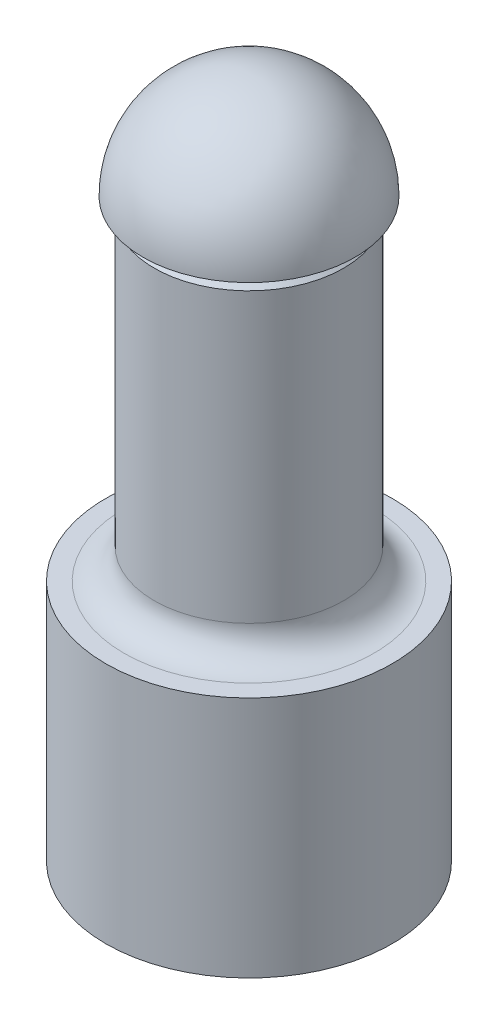
ISO-10303-21;
HEADER;
FILE_DESCRIPTION(('STEP AP214'),'2;1');
FILE_NAME('part.step','',(''),(''),'','','');
FILE_SCHEMA(('AUTOMOTIVE_DESIGN { 1 0 10303 214 1 1 1 1 }'));
ENDSEC;
DATA;
#1=APPLICATION_CONTEXT('core data for automotive mechanical design processes');
#2=APPLICATION_PROTOCOL_DEFINITION('international standard','automotive_design',2000,#1);
#3=PRODUCT_CONTEXT('',#1,'mechanical');
#4=PRODUCT('Part','Part','',(#3));
#5=PRODUCT_RELATED_PRODUCT_CATEGORY('part','',(#4));
#6=PRODUCT_DEFINITION_FORMATION('','',#4);
#7=PRODUCT_DEFINITION_CONTEXT('part definition',#1,'design');
#8=PRODUCT_DEFINITION('design','',#6,#7);
#9=PRODUCT_DEFINITION_SHAPE('','',#8);
#10=(LENGTH_UNIT() NAMED_UNIT(*) SI_UNIT(.MILLI.,.METRE.));
#11=(NAMED_UNIT(*) PLANE_ANGLE_UNIT() SI_UNIT($,.RADIAN.));
#12=(NAMED_UNIT(*) SI_UNIT($,.STERADIAN.) SOLID_ANGLE_UNIT());
#13=UNCERTAINTY_MEASURE_WITH_UNIT(LENGTH_MEASURE(1.E-05),#10,'distance_accuracy_value','');
#14=(GEOMETRIC_REPRESENTATION_CONTEXT(3) GLOBAL_UNCERTAINTY_ASSIGNED_CONTEXT((#13)) GLOBAL_UNIT_ASSIGNED_CONTEXT((#10,
#11,#12)) REPRESENTATION_CONTEXT('',''));
#15=CARTESIAN_POINT('',(0.,0.,0.));
#16=DIRECTION('',(0.,0.,1.));
#17=DIRECTION('',(1.,0.,0.));
#18=AXIS2_PLACEMENT_3D('',#15,#16,#17);
#19=CARTESIAN_POINT('',(0.,38.,0.));
#20=DIRECTION('',(0.,-1.,0.));
#21=DIRECTION('',(0.,0.,-1.));
#22=AXIS2_PLACEMENT_3D('',#19,#20,#21);
#23=CYLINDRICAL_SURFACE('',#22,6.25);
#24=CARTESIAN_POINT('',(0.,18.,0.));
#25=DIRECTION('',(0.,1.,0.));
#26=DIRECTION('',(0.,0.,1.));
#27=AXIS2_PLACEMENT_3D('',#24,#25,#26);
#28=CIRCLE('',#27,6.25);
#29=CARTESIAN_POINT('',(0.,18.,6.25));
#30=VERTEX_POINT('',#29);
#31=EDGE_CURVE('E169',#30,#30,#28,.T.);
#32=ORIENTED_EDGE('',*,*,#31,.T.);
#33=EDGE_LOOP('',(#32));
#34=FACE_BOUND('',#33,.T.);
#35=DIRECTION('',(0.,1.,0.));
#36=VECTOR('',#35,1.);
#37=CARTESIAN_POINT('',(3.75,31.65,-5.));
#38=LINE('',#37,#36);
#39=CARTESIAN_POINT('',(3.75,31.65,-5.));
#40=VERTEX_POINT('',#39);
#41=CARTESIAN_POINT('',(3.75,37.,-5.));
#42=VERTEX_POINT('',#41);
#43=EDGE_CURVE('E116',#40,#42,#38,.T.);
#44=ORIENTED_EDGE('',*,*,#43,.T.);
#45=CARTESIAN_POINT('',(0.,37.,0.));
#46=DIRECTION('',(0.,1.,0.));
#47=DIRECTION('',(0.,0.,1.));
#48=AXIS2_PLACEMENT_3D('',#45,#46,#47);
#49=CIRCLE('',#48,6.25);
#50=CARTESIAN_POINT('',(-3.75,37.,-5.));
#51=VERTEX_POINT('',#50);
#52=EDGE_CURVE('E11',#42,#51,#49,.F.);
#53=ORIENTED_EDGE('',*,*,#52,.T.);
#54=DIRECTION('',(0.,1.,0.));
#55=VECTOR('',#54,1.);
#56=CARTESIAN_POINT('',(-3.75,31.65,-5.));
#57=LINE('',#56,#55);
#58=CARTESIAN_POINT('',(-3.75,31.65,-5.));
#59=VERTEX_POINT('',#58);
#60=EDGE_CURVE('E113',#59,#51,#57,.T.);
#61=ORIENTED_EDGE('',*,*,#60,.F.);
#62=CARTESIAN_POINT('',(0.,31.65,0.));
#63=DIRECTION('',(0.,-1.,0.));
#64=DIRECTION('',(0.,0.,-1.));
#65=AXIS2_PLACEMENT_3D('',#62,#63,#64);
#66=CIRCLE('',#65,6.25);
#67=EDGE_CURVE('E108',#59,#40,#66,.T.);
#68=ORIENTED_EDGE('',*,*,#67,.T.);
#69=EDGE_LOOP('',(#44,#53,#61,#68));
#70=FACE_BOUND('',#69,.T.);
#71=ADVANCED_FACE('F33',(#34,#70),#23,.T.);
#72=CARTESIAN_POINT('',(0.,38.,0.));
#73=DIRECTION('',(0.,-1.,0.));
#74=DIRECTION('',(0.,0.,-1.));
#75=AXIS2_PLACEMENT_3D('',#72,#73,#74);
#76=CONICAL_SURFACE('',#75,5.25,0.785398163397446);
#77=ORIENTED_EDGE('',*,*,#52,.F.);
#78=CARTESIAN_POINT('',(8.29002378512647,33.5688588297679,-5.));
#79=CARTESIAN_POINT('',(8.16614251669939,33.6749361231169,-5.));
#80=CARTESIAN_POINT('',(8.04195113603972,33.7806513017223,-5.));
#81=CARTESIAN_POINT('',(7.79286649556736,33.9912561786033,-5.));
#82=CARTESIAN_POINT('',(7.66797322228908,34.0961458609486,-5.));
#83=CARTESIAN_POINT('',(7.29199983974314,34.4095232011861,-5.));
#84=CARTESIAN_POINT('',(7.03975001545882,34.6166127602617,-5.));
#85=CARTESIAN_POINT('',(6.52455121349022,35.0313769793787,-5.));
#86=CARTESIAN_POINT('',(6.26149618534369,35.2389204254966,-5.));
#87=CARTESIAN_POINT('',(5.73011200220583,35.6470260686123,-5.));
#88=CARTESIAN_POINT('',(5.46178420220096,35.8475900234066,-5.));
#89=CARTESIAN_POINT('',(4.91764396704006,36.2394807648945,-5.));
#90=CARTESIAN_POINT('',(4.64181887128266,36.430790186748,-5.));
#91=CARTESIAN_POINT('',(4.22104619943603,36.7073597513264,-5.));
#92=CARTESIAN_POINT('',(4.07954489930867,36.7978590743667,-5.));
#93=CARTESIAN_POINT('',(3.79389680416413,36.9745691123713,-5.));
#94=CARTESIAN_POINT('',(3.64975022266802,37.0607801714083,-5.));
#95=CARTESIAN_POINT('',(3.35982473727125,37.2271708727431,-5.));
#96=CARTESIAN_POINT('',(3.21407480767328,37.3074004907793,-5.));
#97=CARTESIAN_POINT('',(2.91927948004504,37.4615281677832,-5.));
#98=CARTESIAN_POINT('',(2.7702336973765,37.5354254827892,-5.));
#99=CARTESIAN_POINT('',(2.31806419025659,37.7452623294891,-5.));
#100=CARTESIAN_POINT('',(2.00925718022169,37.869734780335,-5.));
#101=CARTESIAN_POINT('',(1.53026084317916,38.0233372840257,-5.));
#102=CARTESIAN_POINT('',(1.36548992052156,38.0694279705218,-5.));
#103=CARTESIAN_POINT('',(1.03250820499218,38.1470709233458,-5.));
#104=CARTESIAN_POINT('',(0.864297963341555,38.1786255006005,-5.));
#105=CARTESIAN_POINT('',(0.526369836825327,38.2251397551932,-5.));
#106=CARTESIAN_POINT('',(0.356662838696765,38.2401771795937,-5.));
#107=CARTESIAN_POINT('',(0.016591504259577,38.2528593047653,-5.));
#108=CARTESIAN_POINT('',(-0.153772805588727,38.2505046985061,-5.));
#109=CARTESIAN_POINT('',(-0.49307773049109,38.2285963600873,-5.));
#110=CARTESIAN_POINT('',(-0.662020269134588,38.2090717849271,-5.));
#111=CARTESIAN_POINT('',(-0.997293739842109,38.1541968400732,-5.));
#112=CARTESIAN_POINT('',(-1.16362423346523,38.118843842301,-5.));
#113=CARTESIAN_POINT('',(-1.49370325897222,38.0341088453161,-5.));
#114=CARTESIAN_POINT('',(-1.65742970976553,37.9846421665406,-5.));
#115=CARTESIAN_POINT('',(-1.98083951154275,37.874070180418,-5.));
#116=CARTESIAN_POINT('',(-2.14052300377256,37.8129652803045,-5.));
#117=CARTESIAN_POINT('',(-2.50648586309427,37.6601332901038,-5.));
#118=CARTESIAN_POINT('',(-2.71127941478163,37.5648711175865,-5.));
#119=CARTESIAN_POINT('',(-3.11462139225852,37.3618354794766,-5.));
#120=CARTESIAN_POINT('',(-3.31316585944182,37.2540542784267,-5.));
#121=CARTESIAN_POINT('',(-3.70523278153265,37.0288298830716,-5.));
#122=CARTESIAN_POINT('',(-3.89874324848984,36.9113659874474,-5.));
#123=CARTESIAN_POINT('',(-4.28112776214398,36.669257489664,-5.));
#124=CARTESIAN_POINT('',(-4.47000279733919,36.5446144377599,-5.));
#125=CARTESIAN_POINT('',(-4.84481520001847,36.2891558694545,-5.));
#126=CARTESIAN_POINT('',(-5.03073458402061,36.1583140913852,-5.));
#127=CARTESIAN_POINT('',(-5.39938272712267,35.8922102390881,-5.));
#128=CARTESIAN_POINT('',(-5.58211135030662,35.7569479772636,-5.));
#129=CARTESIAN_POINT('',(-5.94469181170131,35.4830654211628,-5.));
#130=CARTESIAN_POINT('',(-6.12454676146867,35.3444492347281,-5.));
#131=CARTESIAN_POINT('',(-6.48202540532649,35.0643835672032,-5.));
#132=CARTESIAN_POINT('',(-6.65964915521256,34.9229341571939,-5.));
#133=CARTESIAN_POINT('',(-6.95948914808953,34.6809149190937,-5.));
#134=CARTESIAN_POINT('',(-7.08218894335945,34.5809427290541,-5.));
#135=CARTESIAN_POINT('',(-7.32679214759397,34.3799941239422,-5.));
#136=CARTESIAN_POINT('',(-7.44869544035717,34.2790175675339,-5.));
#137=CARTESIAN_POINT('',(-7.81149988355673,33.9762760727299,-5.));
#138=CARTESIAN_POINT('',(-8.05132396708158,33.7732177888546,-5.));
#139=CARTESIAN_POINT('',(-8.2900237851265,33.5688588297679,-5.));
#140=B_SPLINE_CURVE_WITH_KNOTS('',3,(#78,#79,#80,#81,#82,#83,#84,#85,#86,#87,#88,#89,#90,#91,
#92,#93,#94,#95,#96,#97,#98,#99,#100,#101,#102,#103,#104,#105,#106,#107,#108,#109,#110,#111,
#112,#113,#114,#115,#116,#117,#118,#119,#120,#121,#122,#123,#124,#125,#126,#127,#128,#129,#130,
#131,#132,#133,#134,#135,#136,#137,#138,#139),.UNSPECIFIED.,.F.,.F.,(4,2,2,2,2,2,2,2,2,2,2,2,2,
2,2,2,2,2,2,2,2,2,2,2,2,2,2,2,2,2,4),(0.,0.489274525632083,0.97855847010853,1.95761612929129,
2.96274011007906,3.96760908918487,4.97429572108149,5.47813426216425,5.98193231189071,
6.4808916726237,6.97990957433002,7.97567851882296,8.48844475876619,9.00112945181244,
9.51139043129033,10.0216310799886,10.5310069385133,11.0404674028509,11.5530512435592,
12.0656171517178,12.7426171608107,13.4200377333872,14.0989461683432,14.777708546595,
15.4596617120322,16.1416438559275,16.8228292346322,17.5039975448865,17.9788049418735,
18.4536801272861,19.3963713875946),.UNSPECIFIED.);
#141=CARTESIAN_POINT('',(1.60078105935824,38.,-5.));
#142=VERTEX_POINT('',#141);
#143=EDGE_CURVE('E126',#42,#142,#140,.T.);
#144=ORIENTED_EDGE('',*,*,#143,.T.);
#145=CARTESIAN_POINT('',(0.,38.,0.));
#146=DIRECTION('',(0.,1.,0.));
#147=DIRECTION('',(0.,0.,1.));
#148=AXIS2_PLACEMENT_3D('',#145,#146,#147);
#149=CIRCLE('',#148,5.25);
#150=CARTESIAN_POINT('',(-1.60078105935824,38.,-5.));
#151=VERTEX_POINT('',#150);
#152=EDGE_CURVE('E42',#151,#142,#149,.T.);
#153=ORIENTED_EDGE('',*,*,#152,.F.);
#154=EDGE_CURVE('E119',#151,#51,#140,.T.);
#155=ORIENTED_EDGE('',*,*,#154,.T.);
#156=EDGE_LOOP('',(#77,#144,#153,#155));
#157=FACE_BOUND('',#156,.T.);
#158=ADVANCED_FACE('F35',(#157),#76,.T.);
#159=CARTESIAN_POINT('',(0.,16.,0.));
#160=DIRECTION('',(0.,-1.,0.));
#161=DIRECTION('',(0.,0.,-1.));
#162=AXIS2_PLACEMENT_3D('',#159,#160,#161);
#163=CYLINDRICAL_SURFACE('',#162,9.45);
#164=CARTESIAN_POINT('',(1.25000000000003,6.35,-9.36696322187719));
#165=CARTESIAN_POINT('',(1.24999705018548,6.28011727092238,-9.36696427605041));
#166=CARTESIAN_POINT('',(1.24411989852458,6.21019171022277,-9.36775371704021));
#167=CARTESIAN_POINT('',(1.22076908923146,6.07228907673858,-9.37082473266134));
#168=CARTESIAN_POINT('',(1.20328353364291,6.00431407781821,-9.37310783817922));
#169=CARTESIAN_POINT('',(1.15724254781036,5.87232899868108,-9.37890316393424));
#170=CARTESIAN_POINT('',(1.12869489799618,5.80831616832437,-9.38241452012323));
#171=CARTESIAN_POINT('',(1.06135722680648,5.68600075125165,-9.39026966975857));
#172=CARTESIAN_POINT('',(1.0225688629955,5.62769724251519,-9.39461332845706));
#173=CARTESIAN_POINT('',(0.935591317286617,5.51807984660169,-9.40367405912545));
#174=CARTESIAN_POINT('',(0.887350831354171,5.46680682390543,-9.40839308149546));
#175=CARTESIAN_POINT('',(0.782948975523049,5.37305916071419,-9.41765532379069));
#176=CARTESIAN_POINT('',(0.726787200818071,5.33058497014516,-9.42219853471618));
#177=CARTESIAN_POINT('',(0.607878651857427,5.25549281594986,-9.43061735760494));
#178=CARTESIAN_POINT('',(0.545108204164357,5.22291203010293,-9.43449042841165));
#179=CARTESIAN_POINT('',(0.414926762421398,5.16876978061365,-9.44111109483429));
#180=CARTESIAN_POINT('',(0.347515960521759,5.14720786100732,-9.44385873701985));
#181=CARTESIAN_POINT('',(0.21038625333779,5.11583803794,-9.44790521738043));
#182=CARTESIAN_POINT('',(0.140683178614884,5.10596203269742,-9.44921244671988));
#183=CARTESIAN_POINT('',(0.000597651733215811,5.09803321429988,-9.45025949635613));
#184=CARTESIAN_POINT('',(-0.0697847705487154,5.09997988354299,-9.44999938527179));
#185=CARTESIAN_POINT('',(-0.208767401030502,5.11558680592925,-9.447947827348));
#186=CARTESIAN_POINT('',(-0.277375995843672,5.12917381098923,-9.44616595656816));
#187=CARTESIAN_POINT('',(-0.41133065984499,5.16756108868917,-9.44128181021904));
#188=CARTESIAN_POINT('',(-0.476676660783738,5.19236159579259,-9.43817950704087));
#189=CARTESIAN_POINT('',(-0.602476586185751,5.25254897933082,-9.43098656704904));
#190=CARTESIAN_POINT('',(-0.662915283406933,5.28796731837672,-9.4268929999646));
#191=CARTESIAN_POINT('',(-0.777018879315241,5.36836206063761,-9.41817504473578));
#192=CARTESIAN_POINT('',(-0.830683430104856,5.41333895442995,-9.41355062935209));
#193=CARTESIAN_POINT('',(-0.930146128423402,5.51198373789969,-9.40424625270296));
#194=CARTESIAN_POINT('',(-0.975880939885119,5.56571549765458,-9.39956613717453));
#195=CARTESIAN_POINT('',(-1.05769303406464,5.6801260197603,-9.39071264991562));
#196=CARTESIAN_POINT('',(-1.09377027959166,5.74080480886251,-9.38653928013662));
#197=CARTESIAN_POINT('',(-1.1552480975655,5.86744597994692,-9.37917190661151));
#198=CARTESIAN_POINT('',(-1.18064320620863,5.93341104531983,-9.37597840428295));
#199=CARTESIAN_POINT('',(-1.21997766406295,6.0687211754532,-9.37094186134598));
#200=CARTESIAN_POINT('',(-1.23391763408467,6.13806605682896,-9.36909874755394));
#201=CARTESIAN_POINT('',(-1.24986142110068,6.27760686825761,-9.36698519739795));
#202=CARTESIAN_POINT('',(-1.25195454804025,6.34779242223,-9.36670299414656));
#203=CARTESIAN_POINT('',(-1.24438124347941,6.48751321692383,-9.36771206548581));
#204=CARTESIAN_POINT('',(-1.23471509349773,6.55704847317333,-9.36900330240807));
#205=CARTESIAN_POINT('',(-1.20397297111229,6.69322472363418,-9.37300300829143));
#206=CARTESIAN_POINT('',(-1.18294058402526,6.7598757301627,-9.37570606213817));
#207=CARTESIAN_POINT('',(-1.13010801341492,6.88870541339743,-9.38222042752868));
#208=CARTESIAN_POINT('',(-1.09830740898957,6.95088391516968,-9.38603178239227));
#209=CARTESIAN_POINT('',(-1.02462289044301,7.06940662574201,-9.39436136925485));
#210=CARTESIAN_POINT('',(-0.982680614245584,7.12571426298288,-9.39888363762351));
#211=CARTESIAN_POINT('',(-0.889985465135742,7.23052296494351,-9.40811297953077));
#212=CARTESIAN_POINT('',(-0.839232207519866,7.27902368862098,-9.4128200611317));
#213=CARTESIAN_POINT('',(-0.729964778311953,7.36715744774746,-9.42192498274736));
#214=CARTESIAN_POINT('',(-0.671402952746825,7.40673165936338,-9.42632064754108));
#215=CARTESIAN_POINT('',(-0.548411314678051,7.4754812434035,-9.43427460167679));
#216=CARTESIAN_POINT('',(-0.483981632444197,7.50465684661215,-9.4378329096023));
#217=CARTESIAN_POINT('',(-0.351275433443851,7.55168474137899,-9.44370160683508));
#218=CARTESIAN_POINT('',(-0.283010955762925,7.56957052616218,-9.44601568431407));
#219=CARTESIAN_POINT('',(-0.144415039046699,7.59361988852714,-9.44915054992485));
#220=CARTESIAN_POINT('',(-0.0740837051493853,7.59978406132586,-9.44997141388111));
#221=CARTESIAN_POINT('',(0.0660761760454183,7.60020317113697,-9.45002689712046));
#222=CARTESIAN_POINT('',(0.135904465109912,7.59454861722582,-9.44927357172438));
#223=CARTESIAN_POINT('',(0.273608748503972,7.57168310908794,-9.44628937114868));
#224=CARTESIAN_POINT('',(0.341484745379725,7.55447216993379,-9.44405849789617));
#225=CARTESIAN_POINT('',(0.47334224817243,7.50901190473291,-9.43836870222859));
#226=CARTESIAN_POINT('',(0.537325458205531,7.48076744951874,-9.43491032176774));
#227=CARTESIAN_POINT('',(0.659658486057076,7.4140513214036,-9.42714761047706));
#228=CARTESIAN_POINT('',(0.718008204629322,7.37557946836958,-9.42284326474778));
#229=CARTESIAN_POINT('',(0.827879508461383,7.28916770101381,-9.41382924967101));
#230=CARTESIAN_POINT('',(0.87934799472036,7.24116055285499,-9.40911684441303));
#231=CARTESIAN_POINT('',(0.973533026574125,7.13718146262693,-9.39983931812206));
#232=CARTESIAN_POINT('',(1.01624750288669,7.08120764267351,-9.39527423212693));
#233=CARTESIAN_POINT('',(1.09187257357751,6.96260404385693,-9.38678715129327));
#234=CARTESIAN_POINT('',(1.12473997251106,6.89994652823979,-9.38286802285812));
#235=CARTESIAN_POINT('',(1.17943821904159,6.76998278804657,-9.37615015205914));
#236=CARTESIAN_POINT('',(1.20128092106387,6.70268164550575,-9.37335020695842));
#237=CARTESIAN_POINT('',(1.22815395024639,6.58753676837314,-9.36985867373476));
#238=CARTESIAN_POINT('',(1.23633423643678,6.54041552494926,-9.36877838051553));
#239=CARTESIAN_POINT('',(1.24725824547966,6.4455361908516,-9.36733029739633));
#240=CARTESIAN_POINT('',(1.25000201675802,6.39777810585431,-9.36696250114977));
#241=CARTESIAN_POINT('',(1.25000000000003,6.35,-9.36696322187719));
#242=B_SPLINE_CURVE_WITH_KNOTS('',3,(#164,#165,#166,#167,#168,#169,#170,#171,#172,#173,#174,
#175,#176,#177,#178,#179,#180,#181,#182,#183,#184,#185,#186,#187,#188,#189,#190,#191,#192,#193,
#194,#195,#196,#197,#198,#199,#200,#201,#202,#203,#204,#205,#206,#207,#208,#209,#210,#211,#212,
#213,#214,#215,#216,#217,#218,#219,#220,#221,#222,#223,#224,#225,#226,#227,#228,#229,#230,#231,
#232,#233,#234,#235,#236,#237,#238,#239,#240,#241),.UNSPECIFIED.,.T.,.F.,(4,2,2,2,2,2,2,2,2,2,2,
2,2,2,2,2,2,2,2,2,2,2,2,2,2,2,2,2,2,2,2,2,2,2,2,2,2,2,4),(0.,0.209473621706196,
0.419162274155716,0.628703710790636,0.838211251766887,1.04888913442063,1.2595777873743,
1.47104864535073,1.68251075189096,1.89273435835743,2.10294876120776,2.31185000203912,
2.52075561099493,2.73028646987189,2.93982808517902,3.15097311590379,3.3621189597253,
3.57337267154488,3.78461493372736,3.99426255818109,4.20390516374019,4.41274951332458,
4.62160202704251,4.83168628714925,5.04177972222452,5.25321961597895,5.46465481678988,
5.67545977292363,5.88625402421286,6.09543990704293,6.30462551703974,6.51371888457112,
6.72281593506481,6.93344331867698,7.14412043333472,7.35570861581199,7.56706879850634,
7.71028504311483,7.85350001201577),.UNSPECIFIED.);
#243=CARTESIAN_POINT('',(1.25000000000003,6.35,-9.36696322187719));
#244=VERTEX_POINT('',#243);
#245=EDGE_CURVE('E99',#244,#244,#242,.T.);
#246=ORIENTED_EDGE('',*,*,#245,.F.);
#247=EDGE_LOOP('',(#246));
#248=FACE_BOUND('',#247,.T.);
#249=CARTESIAN_POINT('',(0.,16.,0.));
#250=DIRECTION('',(0.,1.,0.));
#251=DIRECTION('',(0.,0.,1.));
#252=AXIS2_PLACEMENT_3D('',#249,#250,#251);
#253=CIRCLE('',#252,9.45);
#254=CARTESIAN_POINT('',(0.,16.,9.45));
#255=VERTEX_POINT('',#254);
#256=EDGE_CURVE('E170',#255,#255,#253,.T.);
#257=ORIENTED_EDGE('',*,*,#256,.F.);
#258=EDGE_LOOP('',(#257));
#259=FACE_BOUND('',#258,.T.);
#260=CARTESIAN_POINT('',(0.,0.,0.));
#261=DIRECTION('',(0.,1.,0.));
#262=DIRECTION('',(0.,0.,1.));
#263=AXIS2_PLACEMENT_3D('',#260,#261,#262);
#264=CIRCLE('',#263,9.45);
#265=CARTESIAN_POINT('',(0.,0.,9.45));
#266=VERTEX_POINT('',#265);
#267=EDGE_CURVE('E174',#266,#266,#264,.T.);
#268=ORIENTED_EDGE('',*,*,#267,.T.);
#269=EDGE_LOOP('',(#268));
#270=FACE_BOUND('',#269,.T.);
#271=ADVANCED_FACE('F149',(#248,#259,#270),#163,.T.);
#272=CARTESIAN_POINT('',(0.,16.,0.));
#273=DIRECTION('',(0.,1.,0.));
#274=DIRECTION('',(0.,0.,1.));
#275=AXIS2_PLACEMENT_3D('',#272,#273,#274);
#276=PLANE('',#275);
#277=CARTESIAN_POINT('',(0.,16.,0.));
#278=DIRECTION('',(0.,1.,0.));
#279=DIRECTION('',(0.,0.,1.));
#280=AXIS2_PLACEMENT_3D('',#277,#278,#279);
#281=CIRCLE('',#280,8.25);
#282=CARTESIAN_POINT('',(0.,16.,8.25));
#283=VERTEX_POINT('',#282);
#284=EDGE_CURVE('E166',#283,#283,#281,.F.);
#285=ORIENTED_EDGE('',*,*,#284,.T.);
#286=EDGE_LOOP('',(#285));
#287=FACE_BOUND('',#286,.T.);
#288=ORIENTED_EDGE('',*,*,#256,.T.);
#289=EDGE_LOOP('',(#288));
#290=FACE_BOUND('',#289,.T.);
#291=ADVANCED_FACE('F145',(#287,#290),#276,.T.);
#292=CARTESIAN_POINT('',(0.,0.,0.));
#293=DIRECTION('',(0.,1.,0.));
#294=DIRECTION('',(0.,0.,1.));
#295=AXIS2_PLACEMENT_3D('',#292,#293,#294);
#296=PLANE('',#295);
#297=DIRECTION('',(-1.,0.,0.));
#298=VECTOR('',#297,1.);
#299=CARTESIAN_POINT('',(4.15331193145907,0.,-4.99999999999997));
#300=LINE('',#299,#298);
#301=CARTESIAN_POINT('',(4.15331193145907,0.,-4.99999999999997));
#302=VERTEX_POINT('',#301);
#303=CARTESIAN_POINT('',(-4.153311931459,0.,-5.00000000000003));
#304=VERTEX_POINT('',#303);
#305=EDGE_CURVE('E95',#302,#304,#300,.T.);
#306=ORIENTED_EDGE('',*,*,#305,.T.);
#307=CARTESIAN_POINT('',(0.,0.,0.));
#308=DIRECTION('',(0.,-1.,0.));
#309=DIRECTION('',(0.,0.,-1.));
#310=AXIS2_PLACEMENT_3D('',#307,#308,#309);
#311=CIRCLE('',#310,6.5);
#312=EDGE_CURVE('E49',#302,#304,#311,.T.);
#313=ORIENTED_EDGE('',*,*,#312,.F.);
#314=EDGE_LOOP('',(#306,#313));
#315=FACE_BOUND('',#314,.T.);
#316=ORIENTED_EDGE('',*,*,#267,.F.);
#317=EDGE_LOOP('',(#316));
#318=FACE_BOUND('',#317,.T.);
#319=ADVANCED_FACE('F148',(#315,#318),#296,.F.);
#320=CARTESIAN_POINT('',(0.,18.,0.));
#321=DIRECTION('',(0.,1.,0.));
#322=DIRECTION('',(0.,0.,1.));
#323=AXIS2_PLACEMENT_3D('',#320,#321,#322);
#324=TOROIDAL_SURFACE('',#323,8.25,2.);
#325=ORIENTED_EDGE('',*,*,#284,.F.);
#326=EDGE_LOOP('',(#325));
#327=FACE_BOUND('',#326,.T.);
#328=ORIENTED_EDGE('',*,*,#31,.F.);
#329=EDGE_LOOP('',(#328));
#330=FACE_BOUND('',#329,.T.);
#331=ADVANCED_FACE('F144',(#327,#330),#324,.F.);
#332=CARTESIAN_POINT('',(0.,38.,0.));
#333=DIRECTION('',(0.,1.,0.));
#334=DIRECTION('',(0.,0.,1.));
#335=AXIS2_PLACEMENT_3D('',#332,#333,#334);
#336=PLANE('',#335);
#337=ORIENTED_EDGE('',*,*,#152,.T.);
#338=DIRECTION('',(-1.,0.,0.));
#339=VECTOR('',#338,1.);
#340=CARTESIAN_POINT('',(3.75,38.,-5.));
#341=LINE('',#340,#339);
#342=EDGE_CURVE('E56',#142,#151,#341,.T.);
#343=ORIENTED_EDGE('',*,*,#342,.T.);
#344=EDGE_LOOP('',(#337,#343));
#345=FACE_BOUND('',#344,.T.);
#346=CARTESIAN_POINT('',(0.,38.,0.));
#347=DIRECTION('',(0.,1.,0.));
#348=DIRECTION('',(0.,0.,1.));
#349=AXIS2_PLACEMENT_3D('',#346,#347,#348);
#350=CIRCLE('',#349,7.);
#351=CARTESIAN_POINT('',(0.,38.,7.));
#352=VERTEX_POINT('',#351);
#353=EDGE_CURVE('E127',#352,#352,#350,.T.);
#354=ORIENTED_EDGE('',*,*,#353,.F.);
#355=EDGE_LOOP('',(#354));
#356=FACE_BOUND('',#355,.T.);
#357=ADVANCED_FACE('F140',(#345,#356),#336,.F.);
#358=CARTESIAN_POINT('',(0.,38.,0.));
#359=DIRECTION('',(0.,1.,0.));
#360=DIRECTION('',(0.,0.,-1.));
#361=AXIS2_PLACEMENT_3D('',#358,#359,#360);
#362=SPHERICAL_SURFACE('',#361,7.);
#363=ORIENTED_EDGE('',*,*,#353,.T.);
#364=EDGE_LOOP('',(#363));
#365=FACE_BOUND('',#364,.T.);
#366=ADVANCED_FACE('F135',(#365),#362,.T.);
#367=CARTESIAN_POINT('',(3.75,31.65,-5.));
#368=DIRECTION('',(0.,0.,-1.));
#369=DIRECTION('',(-1.,0.,0.));
#370=AXIS2_PLACEMENT_3D('',#367,#368,#369);
#371=PLANE('',#370);
#372=ORIENTED_EDGE('',*,*,#43,.F.);
#373=DIRECTION('',(-1.,0.,0.));
#374=VECTOR('',#373,1.);
#375=CARTESIAN_POINT('',(3.75,31.65,-5.));
#376=LINE('',#375,#374);
#377=EDGE_CURVE('E111',#40,#59,#376,.T.);
#378=ORIENTED_EDGE('',*,*,#377,.T.);
#379=ORIENTED_EDGE('',*,*,#60,.T.);
#380=ORIENTED_EDGE('',*,*,#154,.F.);
#381=ORIENTED_EDGE('',*,*,#342,.F.);
#382=ORIENTED_EDGE('',*,*,#143,.F.);
#383=EDGE_LOOP('',(#372,#378,#379,#380,#381,#382));
#384=FACE_BOUND('',#383,.T.);
#385=ADVANCED_FACE('F129',(#384),#371,.T.);
#386=CARTESIAN_POINT('',(0.,31.65,0.));
#387=DIRECTION('',(0.,-1.,0.));
#388=DIRECTION('',(0.,0.,-1.));
#389=AXIS2_PLACEMENT_3D('',#386,#387,#388);
#390=PLANE('',#389);
#391=ORIENTED_EDGE('',*,*,#67,.F.);
#392=ORIENTED_EDGE('',*,*,#377,.F.);
#393=EDGE_LOOP('',(#391,#392));
#394=FACE_BOUND('',#393,.T.);
#395=ADVANCED_FACE('F134',(#394),#390,.F.);
#396=CARTESIAN_POINT('',(0.,12.7,0.));
#397=DIRECTION('',(0.,-1.,0.));
#398=DIRECTION('',(0.,0.,-1.));
#399=AXIS2_PLACEMENT_3D('',#396,#397,#398);
#400=CYLINDRICAL_SURFACE('',#399,6.5);
#401=ORIENTED_EDGE('',*,*,#312,.T.);
#402=DIRECTION('',(0.,-1.,0.));
#403=VECTOR('',#402,1.);
#404=CARTESIAN_POINT('',(-4.153311931459,12.7,-5.00000000000003));
#405=LINE('',#404,#403);
#406=CARTESIAN_POINT('',(-4.153311931459,12.7,-5.00000000000003));
#407=VERTEX_POINT('',#406);
#408=EDGE_CURVE('E84',#407,#304,#405,.T.);
#409=ORIENTED_EDGE('',*,*,#408,.F.);
#410=CARTESIAN_POINT('',(0.,12.7,0.));
#411=DIRECTION('',(0.,-1.,0.));
#412=DIRECTION('',(0.,0.,-1.));
#413=AXIS2_PLACEMENT_3D('',#410,#411,#412);
#414=CIRCLE('',#413,6.5);
#415=CARTESIAN_POINT('',(4.15331193145907,12.7,-4.99999999999997));
#416=VERTEX_POINT('',#415);
#417=EDGE_CURVE('E90',#416,#407,#414,.T.);
#418=ORIENTED_EDGE('',*,*,#417,.F.);
#419=DIRECTION('',(0.,-1.,0.));
#420=VECTOR('',#419,1.);
#421=CARTESIAN_POINT('',(4.15331193145907,12.7,-4.99999999999997));
#422=LINE('',#421,#420);
#423=EDGE_CURVE('E86',#416,#302,#422,.T.);
#424=ORIENTED_EDGE('',*,*,#423,.T.);
#425=EDGE_LOOP('',(#401,#409,#418,#424));
#426=FACE_BOUND('',#425,.T.);
#427=ADVANCED_FACE('F92',(#426),#400,.F.);
#428=CARTESIAN_POINT('',(4.15331193145907,12.7,-4.99999999999997));
#429=DIRECTION('',(0.,0.,1.));
#430=DIRECTION('',(1.,0.,0.));
#431=AXIS2_PLACEMENT_3D('',#428,#429,#430);
#432=PLANE('',#431);
#433=CARTESIAN_POINT('',(0.,6.35,-5.));
#434=DIRECTION('',(0.,0.,1.));
#435=DIRECTION('',(1.,0.,0.));
#436=AXIS2_PLACEMENT_3D('',#433,#434,#435);
#437=CIRCLE('',#436,1.25);
#438=CARTESIAN_POINT('',(1.25000000000003,6.35,-5.));
#439=VERTEX_POINT('',#438);
#440=EDGE_CURVE('E215',#439,#439,#437,.T.);
#441=ORIENTED_EDGE('',*,*,#440,.F.);
#442=EDGE_LOOP('',(#441));
#443=FACE_BOUND('',#442,.T.);
#444=ORIENTED_EDGE('',*,*,#305,.F.);
#445=ORIENTED_EDGE('',*,*,#423,.F.);
#446=DIRECTION('',(-1.,0.,0.));
#447=VECTOR('',#446,1.);
#448=CARTESIAN_POINT('',(4.15331193145907,12.7,-4.99999999999997));
#449=LINE('',#448,#447);
#450=EDGE_CURVE('E81',#416,#407,#449,.T.);
#451=ORIENTED_EDGE('',*,*,#450,.T.);
#452=ORIENTED_EDGE('',*,*,#408,.T.);
#453=EDGE_LOOP('',(#444,#445,#451,#452));
#454=FACE_BOUND('',#453,.T.);
#455=ADVANCED_FACE('F83',(#443,#454),#432,.T.);
#456=CARTESIAN_POINT('',(0.,12.7,0.));
#457=DIRECTION('',(0.,-1.,0.));
#458=DIRECTION('',(0.,0.,-1.));
#459=AXIS2_PLACEMENT_3D('',#456,#457,#458);
#460=PLANE('',#459);
#461=ORIENTED_EDGE('',*,*,#417,.T.);
#462=ORIENTED_EDGE('',*,*,#450,.F.);
#463=EDGE_LOOP('',(#461,#462));
#464=FACE_BOUND('',#463,.T.);
#465=ADVANCED_FACE('F94',(#464),#460,.T.);
#466=CARTESIAN_POINT('',(0.,6.35,-9.451));
#467=DIRECTION('',(0.,0.,1.));
#468=DIRECTION('',(1.,0.,0.));
#469=AXIS2_PLACEMENT_3D('',#466,#467,#468);
#470=CYLINDRICAL_SURFACE('',#469,1.25);
#471=ORIENTED_EDGE('',*,*,#245,.T.);
#472=EDGE_LOOP('',(#471));
#473=FACE_BOUND('',#472,.T.);
#474=ORIENTED_EDGE('',*,*,#440,.T.);
#475=EDGE_LOOP('',(#474));
#476=FACE_BOUND('',#475,.T.);
#477=ADVANCED_FACE('F203',(#473,#476),#470,.F.);
#478=CLOSED_SHELL('',(#71,#158,#271,#291,#319,#331,#357,#366,#385,#395,#427,#455,#465,#477));
#479=MANIFOLD_SOLID_BREP('B2',#478);
#480=ADVANCED_BREP_SHAPE_REPRESENTATION('',(#18,#479),#14);
#481=SHAPE_DEFINITION_REPRESENTATION(#9,#480);
ENDSEC;
END-ISO-10303-21;
